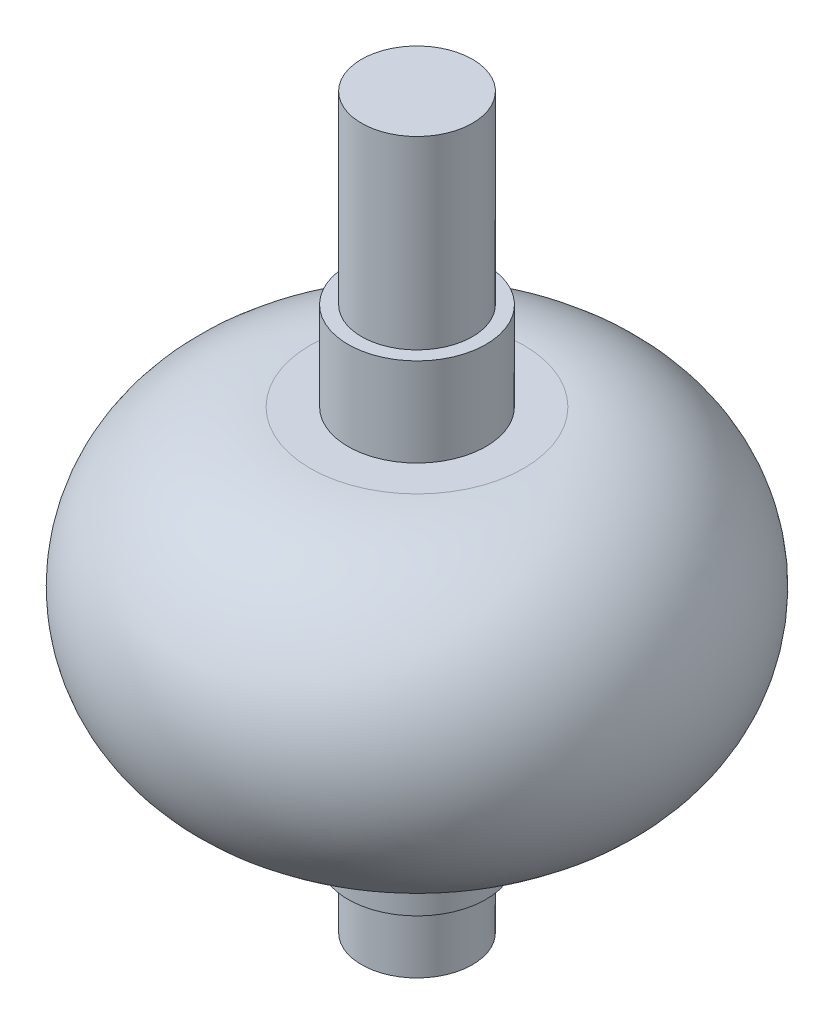
ISO-10303-21;
HEADER;
FILE_DESCRIPTION(('STEP AP214'),'2;1');
FILE_NAME('part.step','',(''),(''),'','','');
FILE_SCHEMA(('AUTOMOTIVE_DESIGN { 1 0 10303 214 1 1 1 1 }'));
ENDSEC;
DATA;
#1=APPLICATION_CONTEXT('core data for automotive mechanical design processes');
#2=APPLICATION_PROTOCOL_DEFINITION('international standard','automotive_design',2000,#1);
#3=PRODUCT_CONTEXT('',#1,'mechanical');
#4=PRODUCT('Part','Part','',(#3));
#5=PRODUCT_RELATED_PRODUCT_CATEGORY('part','',(#4));
#6=PRODUCT_DEFINITION_FORMATION('','',#4);
#7=PRODUCT_DEFINITION_CONTEXT('part definition',#1,'design');
#8=PRODUCT_DEFINITION('design','',#6,#7);
#9=PRODUCT_DEFINITION_SHAPE('','',#8);
#10=(LENGTH_UNIT() NAMED_UNIT(*) SI_UNIT(.MILLI.,.METRE.));
#11=(NAMED_UNIT(*) PLANE_ANGLE_UNIT() SI_UNIT($,.RADIAN.));
#12=(NAMED_UNIT(*) SI_UNIT($,.STERADIAN.) SOLID_ANGLE_UNIT());
#13=UNCERTAINTY_MEASURE_WITH_UNIT(LENGTH_MEASURE(1.E-05),#10,'distance_accuracy_value','');
#14=(GEOMETRIC_REPRESENTATION_CONTEXT(3) GLOBAL_UNCERTAINTY_ASSIGNED_CONTEXT((#13)) GLOBAL_UNIT_ASSIGNED_CONTEXT((#10,
#11,#12)) REPRESENTATION_CONTEXT('',''));
#15=CARTESIAN_POINT('',(0.,0.,0.));
#16=DIRECTION('',(0.,0.,1.));
#17=DIRECTION('',(1.,0.,0.));
#18=AXIS2_PLACEMENT_3D('',#15,#16,#17);
#19=CARTESIAN_POINT('',(0.,42.2213301922771,0.));
#20=DIRECTION('',(0.,-1.,0.));
#21=DIRECTION('',(0.,0.,-1.));
#22=AXIS2_PLACEMENT_3D('',#19,#20,#21);
#23=PLANE('',#22);
#24=CARTESIAN_POINT('',(0.,42.2213301922771,0.));
#25=DIRECTION('',(0.,-1.,0.));
#26=DIRECTION('',(0.,0.,-1.));
#27=AXIS2_PLACEMENT_3D('',#24,#25,#26);
#28=CIRCLE('',#27,3.);
#29=CARTESIAN_POINT('',(0.,42.2213301922771,-3.));
#30=VERTEX_POINT('',#29);
#31=EDGE_CURVE('E10',#30,#30,#28,.T.);
#32=ORIENTED_EDGE('',*,*,#31,.F.);
#33=EDGE_LOOP('',(#32));
#34=FACE_BOUND('',#33,.T.);
#35=ADVANCED_FACE('F37',(#34),#23,.F.);
#36=CARTESIAN_POINT('',(0.,0.,0.));
#37=DIRECTION('',(0.,-1.,0.));
#38=DIRECTION('',(0.,0.,-1.));
#39=AXIS2_PLACEMENT_3D('',#36,#37,#38);
#40=CYLINDRICAL_SURFACE('',#39,3.);
#41=CARTESIAN_POINT('',(0.,32.2213301922771,0.));
#42=DIRECTION('',(0.,-1.,0.));
#43=DIRECTION('',(0.,0.,-1.));
#44=AXIS2_PLACEMENT_3D('',#41,#42,#43);
#45=CIRCLE('',#44,3.);
#46=CARTESIAN_POINT('',(0.,32.2213301922771,-3.));
#47=VERTEX_POINT('',#46);
#48=EDGE_CURVE('E44',#47,#47,#45,.T.);
#49=ORIENTED_EDGE('',*,*,#48,.F.);
#50=EDGE_LOOP('',(#49));
#51=FACE_BOUND('',#50,.T.);
#52=ORIENTED_EDGE('',*,*,#31,.T.);
#53=EDGE_LOOP('',(#52));
#54=FACE_BOUND('',#53,.T.);
#55=ADVANCED_FACE('F131',(#51,#54),#40,.T.);
#56=CARTESIAN_POINT('',(-3.,32.2213301922771,0.));
#57=DIRECTION('',(0.,-1.,0.));
#58=DIRECTION('',(0.,0.,-1.));
#59=AXIS2_PLACEMENT_3D('',#56,#57,#58);
#60=PLANE('',#59);
#61=CARTESIAN_POINT('',(0.,32.2213301922771,0.));
#62=DIRECTION('',(0.,-1.,0.));
#63=DIRECTION('',(0.,0.,-1.));
#64=AXIS2_PLACEMENT_3D('',#61,#62,#63);
#65=CIRCLE('',#64,3.72878142320975);
#66=CARTESIAN_POINT('',(0.,32.2213301922771,-3.72878142320975));
#67=VERTEX_POINT('',#66);
#68=EDGE_CURVE('E49',#67,#67,#65,.T.);
#69=ORIENTED_EDGE('',*,*,#68,.F.);
#70=EDGE_LOOP('',(#69));
#71=FACE_BOUND('',#70,.T.);
#72=ORIENTED_EDGE('',*,*,#48,.T.);
#73=EDGE_LOOP('',(#72));
#74=FACE_BOUND('',#73,.T.);
#75=ADVANCED_FACE('F126',(#71,#74),#60,.F.);
#76=CARTESIAN_POINT('',(0.,0.,0.));
#77=DIRECTION('',(0.,-1.,0.));
#78=DIRECTION('',(0.,0.,-1.));
#79=AXIS2_PLACEMENT_3D('',#76,#77,#78);
#80=CYLINDRICAL_SURFACE('',#79,3.72878142320975);
#81=CARTESIAN_POINT('',(0.,27.4356051617653,0.));
#82=DIRECTION('',(0.,-1.,0.));
#83=DIRECTION('',(0.,0.,-1.));
#84=AXIS2_PLACEMENT_3D('',#81,#82,#83);
#85=CIRCLE('',#84,3.72878142320975);
#86=CARTESIAN_POINT('',(0.,27.4356051617653,-3.72878142320975));
#87=VERTEX_POINT('',#86);
#88=EDGE_CURVE('E54',#87,#87,#85,.T.);
#89=ORIENTED_EDGE('',*,*,#88,.F.);
#90=EDGE_LOOP('',(#89));
#91=FACE_BOUND('',#90,.T.);
#92=ORIENTED_EDGE('',*,*,#68,.T.);
#93=EDGE_LOOP('',(#92));
#94=FACE_BOUND('',#93,.T.);
#95=ADVANCED_FACE('F120',(#91,#94),#80,.T.);
#96=CARTESIAN_POINT('',(-3.72878142320975,27.4356051617653,0.));
#97=DIRECTION('',(0.,-1.,0.));
#98=DIRECTION('',(0.,0.,-1.));
#99=AXIS2_PLACEMENT_3D('',#96,#97,#98);
#100=PLANE('',#99);
#101=CARTESIAN_POINT('',(0.,27.4356051617653,0.));
#102=DIRECTION('',(0.,-1.,0.));
#103=DIRECTION('',(0.,0.,-1.));
#104=AXIS2_PLACEMENT_3D('',#101,#102,#103);
#105=CIRCLE('',#104,5.77392793841226);
#106=CARTESIAN_POINT('',(0.,27.4356051617653,-5.77392793841226));
#107=VERTEX_POINT('',#106);
#108=EDGE_CURVE('E60',#107,#107,#105,.T.);
#109=ORIENTED_EDGE('',*,*,#108,.F.);
#110=EDGE_LOOP('',(#109));
#111=FACE_BOUND('',#110,.T.);
#112=ORIENTED_EDGE('',*,*,#88,.T.);
#113=EDGE_LOOP('',(#112));
#114=FACE_BOUND('',#113,.T.);
#115=ADVANCED_FACE('F114',(#111,#114),#100,.F.);
#116=CARTESIAN_POINT('',(0.,19.0238098715291,0.));
#117=DIRECTION('',(0.,-1.,0.));
#118=DIRECTION('',(0.,0.,-1.));
#119=AXIS2_PLACEMENT_3D('',#116,#117,#118);
#120=DEGENERATE_TOROIDAL_SURFACE('',#119,5.77392793841226,8.41179529023625,.T.);
#121=CARTESIAN_POINT('',(0.,10.6120145812928,0.));
#122=DIRECTION('',(0.,-1.,0.));
#123=DIRECTION('',(0.,0.,-1.));
#124=AXIS2_PLACEMENT_3D('',#121,#122,#123);
#125=CIRCLE('',#124,5.77392793841226);
#126=CARTESIAN_POINT('',(0.,10.6120145812928,-5.77392793841226));
#127=VERTEX_POINT('',#126);
#128=EDGE_CURVE('E64',#127,#127,#125,.T.);
#129=ORIENTED_EDGE('',*,*,#128,.F.);
#130=EDGE_LOOP('',(#129));
#131=FACE_BOUND('',#130,.T.);
#132=ORIENTED_EDGE('',*,*,#108,.T.);
#133=EDGE_LOOP('',(#132));
#134=FACE_BOUND('',#133,.T.);
#135=ADVANCED_FACE('F108',(#131,#134),#120,.T.);
#136=CARTESIAN_POINT('',(-5.77392793841226,10.6120145812928,0.));
#137=DIRECTION('',(0.,1.,0.));
#138=DIRECTION('',(0.,0.,1.));
#139=AXIS2_PLACEMENT_3D('',#136,#137,#138);
#140=PLANE('',#139);
#141=CARTESIAN_POINT('',(0.,10.6120145812928,0.));
#142=DIRECTION('',(0.,-1.,0.));
#143=DIRECTION('',(0.,0.,-1.));
#144=AXIS2_PLACEMENT_3D('',#141,#142,#143);
#145=CIRCLE('',#144,3.72878142320975);
#146=CARTESIAN_POINT('',(0.,10.6120145812928,-3.72878142320975));
#147=VERTEX_POINT('',#146);
#148=EDGE_CURVE('E68',#147,#147,#145,.T.);
#149=ORIENTED_EDGE('',*,*,#148,.F.);
#150=EDGE_LOOP('',(#149));
#151=FACE_BOUND('',#150,.T.);
#152=ORIENTED_EDGE('',*,*,#128,.T.);
#153=EDGE_LOOP('',(#152));
#154=FACE_BOUND('',#153,.T.);
#155=ADVANCED_FACE('F102',(#151,#154),#140,.F.);
#156=CARTESIAN_POINT('',(0.,0.,0.));
#157=DIRECTION('',(0.,-1.,0.));
#158=DIRECTION('',(0.,0.,-1.));
#159=AXIS2_PLACEMENT_3D('',#156,#157,#158);
#160=CYLINDRICAL_SURFACE('',#159,3.72878142320975);
#161=CARTESIAN_POINT('',(0.,6.21854974255129,0.));
#162=DIRECTION('',(0.,-1.,0.));
#163=DIRECTION('',(0.,0.,-1.));
#164=AXIS2_PLACEMENT_3D('',#161,#162,#163);
#165=CIRCLE('',#164,3.72878142320975);
#166=CARTESIAN_POINT('',(0.,6.21854974255129,-3.72878142320975));
#167=VERTEX_POINT('',#166);
#168=EDGE_CURVE('E72',#167,#167,#165,.T.);
#169=ORIENTED_EDGE('',*,*,#168,.F.);
#170=EDGE_LOOP('',(#169));
#171=FACE_BOUND('',#170,.T.);
#172=ORIENTED_EDGE('',*,*,#148,.T.);
#173=EDGE_LOOP('',(#172));
#174=FACE_BOUND('',#173,.T.);
#175=ADVANCED_FACE('F96',(#171,#174),#160,.T.);
#176=CARTESIAN_POINT('',(-3.72878142320975,6.21854974255129,0.));
#177=DIRECTION('',(0.,1.,0.));
#178=DIRECTION('',(0.,0.,1.));
#179=AXIS2_PLACEMENT_3D('',#176,#177,#178);
#180=PLANE('',#179);
#181=CARTESIAN_POINT('',(0.,6.21854974255129,0.));
#182=DIRECTION('',(0.,-1.,0.));
#183=DIRECTION('',(0.,0.,-1.));
#184=AXIS2_PLACEMENT_3D('',#181,#182,#183);
#185=CIRCLE('',#184,3.);
#186=CARTESIAN_POINT('',(0.,6.21854974255129,-3.));
#187=VERTEX_POINT('',#186);
#188=EDGE_CURVE('E76',#187,#187,#185,.T.);
#189=ORIENTED_EDGE('',*,*,#188,.F.);
#190=EDGE_LOOP('',(#189));
#191=FACE_BOUND('',#190,.T.);
#192=ORIENTED_EDGE('',*,*,#168,.T.);
#193=EDGE_LOOP('',(#192));
#194=FACE_BOUND('',#193,.T.);
#195=ADVANCED_FACE('F90',(#191,#194),#180,.F.);
#196=CARTESIAN_POINT('',(0.,0.,0.));
#197=DIRECTION('',(0.,-1.,0.));
#198=DIRECTION('',(0.,0.,-1.));
#199=AXIS2_PLACEMENT_3D('',#196,#197,#198);
#200=CYLINDRICAL_SURFACE('',#199,3.);
#201=CARTESIAN_POINT('',(0.,2.79565731358064,0.));
#202=DIRECTION('',(0.,-1.,0.));
#203=DIRECTION('',(0.,0.,-1.));
#204=AXIS2_PLACEMENT_3D('',#201,#202,#203);
#205=CIRCLE('',#204,3.);
#206=CARTESIAN_POINT('',(0.,2.79565731358064,-3.));
#207=VERTEX_POINT('',#206);
#208=EDGE_CURVE('E80',#207,#207,#205,.T.);
#209=ORIENTED_EDGE('',*,*,#208,.F.);
#210=EDGE_LOOP('',(#209));
#211=FACE_BOUND('',#210,.T.);
#212=ORIENTED_EDGE('',*,*,#188,.T.);
#213=EDGE_LOOP('',(#212));
#214=FACE_BOUND('',#213,.T.);
#215=ADVANCED_FACE('F87',(#211,#214),#200,.T.);
#216=CARTESIAN_POINT('',(-3.,2.79565731358064,0.));
#217=DIRECTION('',(0.,1.,0.));
#218=DIRECTION('',(0.,0.,1.));
#219=AXIS2_PLACEMENT_3D('',#216,#217,#218);
#220=PLANE('',#219);
#221=ORIENTED_EDGE('',*,*,#208,.T.);
#222=EDGE_LOOP('',(#221));
#223=FACE_BOUND('',#222,.T.);
#224=ADVANCED_FACE('F85',(#223),#220,.F.);
#225=CLOSED_SHELL('',(#35,#55,#75,#95,#115,#135,#155,#175,#195,#215,#224));
#226=MANIFOLD_SOLID_BREP('B2',#225);
#227=ADVANCED_BREP_SHAPE_REPRESENTATION('',(#18,#226),#14);
#228=SHAPE_DEFINITION_REPRESENTATION(#9,#227);
ENDSEC;
END-ISO-10303-21;
